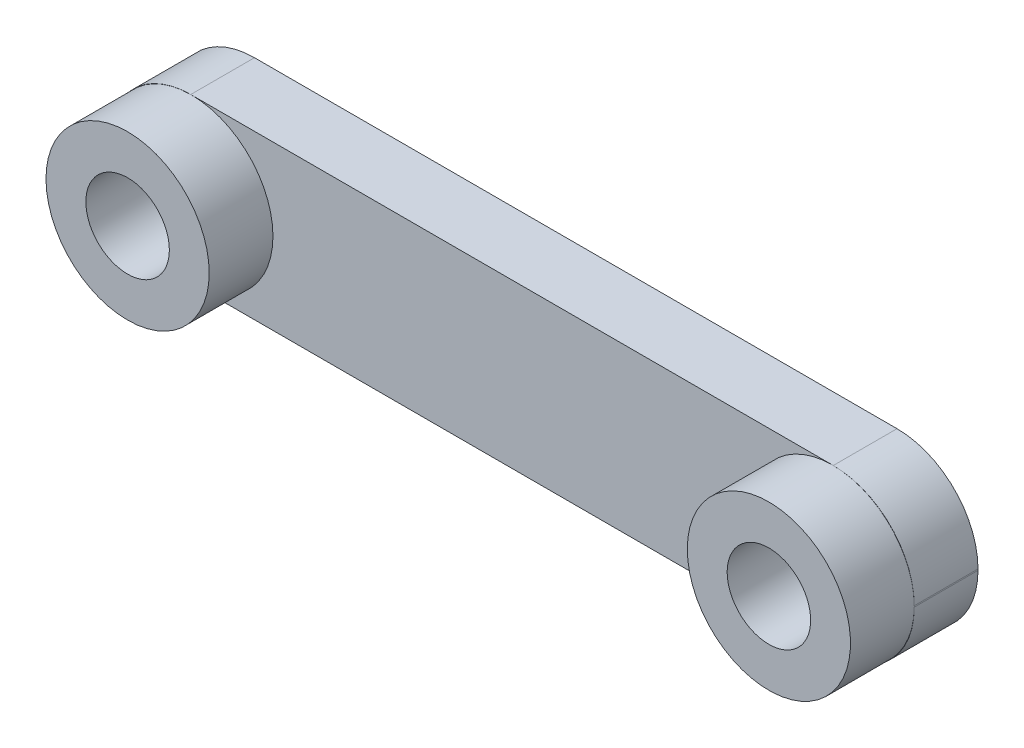
ISO-10303-21;
HEADER;
FILE_DESCRIPTION(('STEP AP214'),'2;1');
FILE_NAME('part.step','',(''),(''),'','','');
FILE_SCHEMA(('AUTOMOTIVE_DESIGN { 1 0 10303 214 1 1 1 1 }'));
ENDSEC;
DATA;
#1=APPLICATION_CONTEXT('core data for automotive mechanical design processes');
#2=APPLICATION_PROTOCOL_DEFINITION('international standard','automotive_design',2000,#1);
#3=PRODUCT_CONTEXT('',#1,'mechanical');
#4=PRODUCT('Part','Part','',(#3));
#5=PRODUCT_RELATED_PRODUCT_CATEGORY('part','',(#4));
#6=PRODUCT_DEFINITION_FORMATION('','',#4);
#7=PRODUCT_DEFINITION_CONTEXT('part definition',#1,'design');
#8=PRODUCT_DEFINITION('design','',#6,#7);
#9=PRODUCT_DEFINITION_SHAPE('','',#8);
#10=(LENGTH_UNIT() NAMED_UNIT(*) SI_UNIT(.MILLI.,.METRE.));
#11=(NAMED_UNIT(*) PLANE_ANGLE_UNIT() SI_UNIT($,.RADIAN.));
#12=(NAMED_UNIT(*) SI_UNIT($,.STERADIAN.) SOLID_ANGLE_UNIT());
#13=UNCERTAINTY_MEASURE_WITH_UNIT(LENGTH_MEASURE(1.E-05),#10,'distance_accuracy_value','');
#14=(GEOMETRIC_REPRESENTATION_CONTEXT(3) GLOBAL_UNCERTAINTY_ASSIGNED_CONTEXT((#13)) GLOBAL_UNIT_ASSIGNED_CONTEXT((#10,
#11,#12)) REPRESENTATION_CONTEXT('',''));
#15=CARTESIAN_POINT('',(0.,0.,0.));
#16=DIRECTION('',(0.,0.,1.));
#17=DIRECTION('',(1.,0.,0.));
#18=AXIS2_PLACEMENT_3D('',#15,#16,#17);
#19=CARTESIAN_POINT('',(0.,0.,10.));
#20=DIRECTION('',(0.,0.,1.));
#21=DIRECTION('',(1.,0.,0.));
#22=AXIS2_PLACEMENT_3D('',#19,#20,#21);
#23=PLANE('',#22);
#24=CARTESIAN_POINT('',(50.296,0.,10.));
#25=DIRECTION('',(0.,0.,-1.));
#26=DIRECTION('',(-1.,0.,0.));
#27=AXIS2_PLACEMENT_3D('',#24,#25,#26);
#28=CIRCLE('',#27,12.8);
#29=CARTESIAN_POINT('',(50.296,12.8,10.));
#30=VERTEX_POINT('',#29);
#31=CARTESIAN_POINT('',(63.0947590335642,0.178233556766903,10.));
#32=VERTEX_POINT('',#31);
#33=EDGE_CURVE('E259',#30,#32,#28,.T.);
#34=ORIENTED_EDGE('',*,*,#33,.T.);
#35=CARTESIAN_POINT('',(50.395,0.100000000000003,10.));
#36=DIRECTION('',(0.,0.,1.));
#37=DIRECTION('',(1.,0.,0.));
#38=AXIS2_PLACEMENT_3D('',#35,#36,#37);
#39=CIRCLE('',#38,12.7);
#40=CARTESIAN_POINT('',(50.395,12.8,10.));
#41=VERTEX_POINT('',#40);
#42=EDGE_CURVE('E45',#32,#41,#39,.T.);
#43=ORIENTED_EDGE('',*,*,#42,.T.);
#44=DIRECTION('',(-1.,0.,0.));
#45=VECTOR('',#44,1.);
#46=CARTESIAN_POINT('',(-63.095,12.8,10.));
#47=LINE('',#46,#45);
#48=EDGE_CURVE('E435',#41,#30,#47,.T.);
#49=ORIENTED_EDGE('',*,*,#48,.T.);
#50=EDGE_LOOP('',(#34,#43,#49));
#51=FACE_BOUND('',#50,.T.);
#52=ADVANCED_FACE('F33',(#51),#23,.T.);
#53=CARTESIAN_POINT('',(50.296,0.,10.));
#54=DIRECTION('',(0.,0.,1.));
#55=DIRECTION('',(1.,0.,0.));
#56=AXIS2_PLACEMENT_3D('',#53,#54,#55);
#57=CIRCLE('',#56,12.8);
#58=CARTESIAN_POINT('',(50.296,-12.8,10.));
#59=VERTEX_POINT('',#58);
#60=EDGE_CURVE('E353',#30,#59,#57,.T.);
#61=ORIENTED_EDGE('',*,*,#60,.F.);
#62=CARTESIAN_POINT('',(-50.296,12.8,10.));
#63=VERTEX_POINT('',#62);
#64=EDGE_CURVE('E451',#30,#63,#47,.T.);
#65=ORIENTED_EDGE('',*,*,#64,.T.);
#66=CARTESIAN_POINT('',(-50.296,0.,10.));
#67=DIRECTION('',(0.,0.,1.));
#68=DIRECTION('',(1.,0.,0.));
#69=AXIS2_PLACEMENT_3D('',#66,#67,#68);
#70=CIRCLE('',#69,12.8);
#71=CARTESIAN_POINT('',(-50.296,-12.8,10.));
#72=VERTEX_POINT('',#71);
#73=EDGE_CURVE('E287',#72,#63,#70,.T.);
#74=ORIENTED_EDGE('',*,*,#73,.F.);
#75=DIRECTION('',(1.,0.,0.));
#76=VECTOR('',#75,1.);
#77=CARTESIAN_POINT('',(-63.095,-12.8,10.));
#78=LINE('',#77,#76);
#79=EDGE_CURVE('E449',#72,#59,#78,.T.);
#80=ORIENTED_EDGE('',*,*,#79,.T.);
#81=EDGE_LOOP('',(#61,#65,#74,#80));
#82=FACE_BOUND('',#81,.T.);
#83=ADVANCED_FACE('F481',(#82),#23,.T.);
#84=CARTESIAN_POINT('',(-50.395,12.8,10.));
#85=VERTEX_POINT('',#84);
#86=EDGE_CURVE('E452',#63,#85,#47,.T.);
#87=ORIENTED_EDGE('',*,*,#86,.T.);
#88=CARTESIAN_POINT('',(-50.395,0.100000000000003,10.));
#89=DIRECTION('',(0.,0.,1.));
#90=DIRECTION('',(1.,0.,0.));
#91=AXIS2_PLACEMENT_3D('',#88,#89,#90);
#92=CIRCLE('',#91,12.7);
#93=CARTESIAN_POINT('',(-63.0947590335641,0.178233556777625,10.));
#94=VERTEX_POINT('',#93);
#95=EDGE_CURVE('E11',#85,#94,#92,.T.);
#96=ORIENTED_EDGE('',*,*,#95,.T.);
#97=EDGE_CURVE('E281',#63,#94,#70,.T.);
#98=ORIENTED_EDGE('',*,*,#97,.F.);
#99=EDGE_LOOP('',(#87,#96,#98));
#100=FACE_BOUND('',#99,.T.);
#101=ADVANCED_FACE('F476',(#100),#23,.T.);
#102=CARTESIAN_POINT('',(-63.0947590335641,-0.178233556777632,10.));
#103=VERTEX_POINT('',#102);
#104=EDGE_CURVE('E291',#103,#72,#70,.T.);
#105=ORIENTED_EDGE('',*,*,#104,.F.);
#106=CARTESIAN_POINT('',(-50.395,-0.0999999999999959,10.));
#107=DIRECTION('',(0.,0.,1.));
#108=DIRECTION('',(1.,0.,0.));
#109=AXIS2_PLACEMENT_3D('',#106,#107,#108);
#110=CIRCLE('',#109,12.7);
#111=CARTESIAN_POINT('',(-50.395,-12.8,10.));
#112=VERTEX_POINT('',#111);
#113=EDGE_CURVE('E332',#103,#112,#110,.T.);
#114=ORIENTED_EDGE('',*,*,#113,.T.);
#115=EDGE_CURVE('E292',#112,#72,#78,.T.);
#116=ORIENTED_EDGE('',*,*,#115,.T.);
#117=EDGE_LOOP('',(#105,#114,#116));
#118=FACE_BOUND('',#117,.T.);
#119=ADVANCED_FACE('F367',(#118),#23,.T.);
#120=CARTESIAN_POINT('',(63.095,12.8,10.));
#121=DIRECTION('',(-1.,0.,0.));
#122=DIRECTION('',(0.,-1.,0.));
#123=AXIS2_PLACEMENT_3D('',#120,#121,#122);
#124=PLANE('',#123);
#125=CARTESIAN_POINT('',(50.296,0.,10.));
#126=DIRECTION('',(0.,0.,1.));
#127=DIRECTION('',(0.999969477597343,-0.00781305789662437,0.));
#128=AXIS2_PLACEMENT_3D('',#125,#126,#127);
#129=CIRCLE('',#128,12.8);
#130=CARTESIAN_POINT('',(63.095304656623,-0.100007141076792,10.));
#131=VERTEX_POINT('',#130);
#132=CARTESIAN_POINT('',(63.095304656623,0.100007141076795,10.));
#133=VERTEX_POINT('',#132);
#134=EDGE_CURVE('E344',#131,#133,#129,.T.);
#135=ORIENTED_EDGE('',*,*,#134,.F.);
#136=DIRECTION('',(0.,0.,-1.));
#137=VECTOR('',#136,1.);
#138=CARTESIAN_POINT('',(63.095,-0.100000000000003,10.));
#139=LINE('',#138,#137);
#140=CARTESIAN_POINT('',(63.095,-0.0999999999999994,0.));
#141=VERTEX_POINT('',#140);
#142=EDGE_CURVE('E160',#131,#141,#139,.T.);
#143=ORIENTED_EDGE('',*,*,#142,.T.);
#144=DIRECTION('',(0.,1.,0.));
#145=VECTOR('',#144,1.);
#146=CARTESIAN_POINT('',(63.095,12.8,0.));
#147=LINE('',#146,#145);
#148=CARTESIAN_POINT('',(63.095,0.0999999999999994,0.));
#149=VERTEX_POINT('',#148);
#150=EDGE_CURVE('E286',#141,#149,#147,.T.);
#151=ORIENTED_EDGE('',*,*,#150,.T.);
#152=DIRECTION('',(0.,0.,-1.));
#153=VECTOR('',#152,1.);
#154=CARTESIAN_POINT('',(63.095,0.0999999999999959,10.));
#155=LINE('',#154,#153);
#156=EDGE_CURVE('E339',#149,#133,#155,.F.);
#157=ORIENTED_EDGE('',*,*,#156,.T.);
#158=EDGE_LOOP('',(#135,#143,#151,#157));
#159=FACE_BOUND('',#158,.T.);
#160=ADVANCED_FACE('F357',(#159),#124,.F.);
#161=CARTESIAN_POINT('',(-63.095,12.8,10.));
#162=DIRECTION('',(0.,-1.,0.));
#163=DIRECTION('',(0.,0.,-1.));
#164=AXIS2_PLACEMENT_3D('',#161,#162,#163);
#165=PLANE('',#164);
#166=ORIENTED_EDGE('',*,*,#48,.F.);
#167=DIRECTION('',(0.,0.,-1.));
#168=VECTOR('',#167,1.);
#169=CARTESIAN_POINT('',(50.395,12.8,10.));
#170=LINE('',#169,#168);
#171=CARTESIAN_POINT('',(50.395,12.8,0.));
#172=VERTEX_POINT('',#171);
#173=EDGE_CURVE('E430',#41,#172,#170,.T.);
#174=ORIENTED_EDGE('',*,*,#173,.T.);
#175=DIRECTION('',(-1.,0.,0.));
#176=VECTOR('',#175,1.);
#177=CARTESIAN_POINT('',(-63.095,12.8,0.));
#178=LINE('',#177,#176);
#179=CARTESIAN_POINT('',(-50.395,12.8,0.));
#180=VERTEX_POINT('',#179);
#181=EDGE_CURVE('E433',#172,#180,#178,.T.);
#182=ORIENTED_EDGE('',*,*,#181,.T.);
#183=DIRECTION('',(0.,0.,-1.));
#184=VECTOR('',#183,1.);
#185=CARTESIAN_POINT('',(-50.395,12.8,10.));
#186=LINE('',#185,#184);
#187=EDGE_CURVE('E60',#180,#85,#186,.F.);
#188=ORIENTED_EDGE('',*,*,#187,.T.);
#189=ORIENTED_EDGE('',*,*,#86,.F.);
#190=ORIENTED_EDGE('',*,*,#64,.F.);
#191=EDGE_LOOP('',(#166,#174,#182,#188,#189,#190));
#192=FACE_BOUND('',#191,.T.);
#193=ADVANCED_FACE('F366',(#192),#165,.F.);
#194=CARTESIAN_POINT('',(-63.095,12.8,10.));
#195=DIRECTION('',(1.,0.,0.));
#196=DIRECTION('',(0.,0.,-1.));
#197=AXIS2_PLACEMENT_3D('',#194,#195,#196);
#198=PLANE('',#197);
#199=DIRECTION('',(0.,-1.,0.));
#200=VECTOR('',#199,1.);
#201=CARTESIAN_POINT('',(-63.095,12.8,0.));
#202=LINE('',#201,#200);
#203=CARTESIAN_POINT('',(-63.095,0.100000000000006,0.));
#204=VERTEX_POINT('',#203);
#205=CARTESIAN_POINT('',(-63.095,-0.0999999999999925,0.));
#206=VERTEX_POINT('',#205);
#207=EDGE_CURVE('E444',#204,#206,#202,.T.);
#208=ORIENTED_EDGE('',*,*,#207,.T.);
#209=DIRECTION('',(0.,0.,-1.));
#210=VECTOR('',#209,1.);
#211=CARTESIAN_POINT('',(-63.095,-0.0999999999999959,10.));
#212=LINE('',#211,#210);
#213=CARTESIAN_POINT('',(-63.095304656623,-0.100007141076798,10.));
#214=VERTEX_POINT('',#213);
#215=EDGE_CURVE('E395',#206,#214,#212,.F.);
#216=ORIENTED_EDGE('',*,*,#215,.T.);
#217=CARTESIAN_POINT('',(-50.296,0.,10.));
#218=DIRECTION('',(0.,0.,1.));
#219=DIRECTION('',(-0.999969477597343,0.00781305789662511,0.));
#220=AXIS2_PLACEMENT_3D('',#217,#218,#219);
#221=CIRCLE('',#220,12.8);
#222=CARTESIAN_POINT('',(-63.095304656623,0.100007141076802,10.));
#223=VERTEX_POINT('',#222);
#224=EDGE_CURVE('E390',#223,#214,#221,.T.);
#225=ORIENTED_EDGE('',*,*,#224,.F.);
#226=DIRECTION('',(0.,0.,-1.));
#227=VECTOR('',#226,1.);
#228=CARTESIAN_POINT('',(-63.095,0.100000000000003,10.));
#229=LINE('',#228,#227);
#230=EDGE_CURVE('E393',#223,#204,#229,.T.);
#231=ORIENTED_EDGE('',*,*,#230,.T.);
#232=EDGE_LOOP('',(#208,#216,#225,#231));
#233=FACE_BOUND('',#232,.T.);
#234=ADVANCED_FACE('F370',(#233),#198,.F.);
#235=CARTESIAN_POINT('',(-63.095,-12.8,10.));
#236=DIRECTION('',(0.,1.,0.));
#237=DIRECTION('',(0.,0.,1.));
#238=AXIS2_PLACEMENT_3D('',#235,#236,#237);
#239=PLANE('',#238);
#240=ORIENTED_EDGE('',*,*,#115,.F.);
#241=DIRECTION('',(0.,0.,-1.));
#242=VECTOR('',#241,1.);
#243=CARTESIAN_POINT('',(-50.395,-12.8,10.));
#244=LINE('',#243,#242);
#245=CARTESIAN_POINT('',(-50.395,-12.8,0.));
#246=VERTEX_POINT('',#245);
#247=EDGE_CURVE('E465',#112,#246,#244,.T.);
#248=ORIENTED_EDGE('',*,*,#247,.T.);
#249=DIRECTION('',(1.,0.,0.));
#250=VECTOR('',#249,1.);
#251=CARTESIAN_POINT('',(-63.095,-12.8,0.));
#252=LINE('',#251,#250);
#253=CARTESIAN_POINT('',(50.395,-12.8,0.));
#254=VERTEX_POINT('',#253);
#255=EDGE_CURVE('E379',#246,#254,#252,.T.);
#256=ORIENTED_EDGE('',*,*,#255,.T.);
#257=DIRECTION('',(0.,0.,-1.));
#258=VECTOR('',#257,1.);
#259=CARTESIAN_POINT('',(50.395,-12.8,10.));
#260=LINE('',#259,#258);
#261=CARTESIAN_POINT('',(50.395,-12.8,10.));
#262=VERTEX_POINT('',#261);
#263=EDGE_CURVE('E463',#254,#262,#260,.F.);
#264=ORIENTED_EDGE('',*,*,#263,.T.);
#265=EDGE_CURVE('E450',#59,#262,#78,.T.);
#266=ORIENTED_EDGE('',*,*,#265,.F.);
#267=ORIENTED_EDGE('',*,*,#79,.F.);
#268=EDGE_LOOP('',(#240,#248,#256,#264,#266,#267));
#269=FACE_BOUND('',#268,.T.);
#270=ADVANCED_FACE('F374',(#269),#239,.F.);
#271=ORIENTED_EDGE('',*,*,#265,.T.);
#272=CARTESIAN_POINT('',(50.395,-0.0999999999999959,10.));
#273=DIRECTION('',(0.,0.,1.));
#274=DIRECTION('',(1.,0.,0.));
#275=AXIS2_PLACEMENT_3D('',#272,#273,#274);
#276=CIRCLE('',#275,12.7);
#277=CARTESIAN_POINT('',(63.0947590335642,-0.1782335567678,10.));
#278=VERTEX_POINT('',#277);
#279=EDGE_CURVE('E467',#262,#278,#276,.T.);
#280=ORIENTED_EDGE('',*,*,#279,.T.);
#281=EDGE_CURVE('E149',#59,#278,#57,.T.);
#282=ORIENTED_EDGE('',*,*,#281,.F.);
#283=EDGE_LOOP('',(#271,#280,#282));
#284=FACE_BOUND('',#283,.T.);
#285=ADVANCED_FACE('F320',(#284),#23,.T.);
#286=CARTESIAN_POINT('',(0.,0.,0.));
#287=DIRECTION('',(0.,0.,1.));
#288=DIRECTION('',(1.,0.,0.));
#289=AXIS2_PLACEMENT_3D('',#286,#287,#288);
#290=PLANE('',#289);
#291=ORIENTED_EDGE('',*,*,#255,.F.);
#292=CARTESIAN_POINT('',(-50.395,-0.0999999999999959,0.));
#293=DIRECTION('',(0.,0.,1.));
#294=DIRECTION('',(1.,0.,0.));
#295=AXIS2_PLACEMENT_3D('',#292,#293,#294);
#296=CIRCLE('',#295,12.7);
#297=EDGE_CURVE('E396',#246,#206,#296,.F.);
#298=ORIENTED_EDGE('',*,*,#297,.T.);
#299=ORIENTED_EDGE('',*,*,#207,.F.);
#300=CARTESIAN_POINT('',(-50.395,0.100000000000003,0.));
#301=DIRECTION('',(0.,0.,1.));
#302=DIRECTION('',(1.,0.,0.));
#303=AXIS2_PLACEMENT_3D('',#300,#301,#302);
#304=CIRCLE('',#303,12.7);
#305=EDGE_CURVE('E443',#204,#180,#304,.F.);
#306=ORIENTED_EDGE('',*,*,#305,.T.);
#307=ORIENTED_EDGE('',*,*,#181,.F.);
#308=CARTESIAN_POINT('',(50.395,0.100000000000003,0.));
#309=DIRECTION('',(0.,0.,1.));
#310=DIRECTION('',(1.,0.,0.));
#311=AXIS2_PLACEMENT_3D('',#308,#309,#310);
#312=CIRCLE('',#311,12.7);
#313=EDGE_CURVE('E440',#172,#149,#312,.F.);
#314=ORIENTED_EDGE('',*,*,#313,.T.);
#315=ORIENTED_EDGE('',*,*,#150,.F.);
#316=CARTESIAN_POINT('',(50.395,-0.0999999999999959,0.));
#317=DIRECTION('',(0.,0.,1.));
#318=DIRECTION('',(1.,0.,0.));
#319=AXIS2_PLACEMENT_3D('',#316,#317,#318);
#320=CIRCLE('',#319,12.7);
#321=EDGE_CURVE('E466',#141,#254,#320,.F.);
#322=ORIENTED_EDGE('',*,*,#321,.T.);
#323=EDGE_LOOP('',(#291,#298,#299,#306,#307,#314,#315,#322));
#324=FACE_BOUND('',#323,.T.);
#325=ADVANCED_FACE('F438',(#324),#290,.F.);
#326=CARTESIAN_POINT('',(-50.296,0.,20.));
#327=DIRECTION('',(0.,0.,1.));
#328=DIRECTION('',(1.,0.,0.));
#329=AXIS2_PLACEMENT_3D('',#326,#327,#328);
#330=PLANE('',#329);
#331=CARTESIAN_POINT('',(-50.296,0.,20.));
#332=DIRECTION('',(0.,0.,1.));
#333=DIRECTION('',(1.,0.,0.));
#334=AXIS2_PLACEMENT_3D('',#331,#332,#333);
#335=CIRCLE('',#334,12.8);
#336=CARTESIAN_POINT('',(-37.496,0.,20.));
#337=VERTEX_POINT('',#336);
#338=EDGE_CURVE('E283',#337,#337,#335,.T.);
#339=ORIENTED_EDGE('',*,*,#338,.T.);
#340=EDGE_LOOP('',(#339));
#341=FACE_BOUND('',#340,.T.);
#342=CARTESIAN_POINT('',(-50.296,0.,20.));
#343=DIRECTION('',(0.,0.,1.));
#344=DIRECTION('',(1.,0.,0.));
#345=AXIS2_PLACEMENT_3D('',#342,#343,#344);
#346=CIRCLE('',#345,6.55);
#347=CARTESIAN_POINT('',(-43.746,0.,20.));
#348=VERTEX_POINT('',#347);
#349=EDGE_CURVE('E274',#348,#348,#346,.T.);
#350=ORIENTED_EDGE('',*,*,#349,.F.);
#351=EDGE_LOOP('',(#350));
#352=FACE_BOUND('',#351,.T.);
#353=ADVANCED_FACE('F318',(#341,#352),#330,.T.);
#354=CARTESIAN_POINT('',(-50.296,0.,20.));
#355=DIRECTION('',(0.,0.,-1.));
#356=DIRECTION('',(-1.,0.,0.));
#357=AXIS2_PLACEMENT_3D('',#354,#355,#356);
#358=CYLINDRICAL_SURFACE('',#357,12.8);
#359=ORIENTED_EDGE('',*,*,#338,.F.);
#360=EDGE_LOOP('',(#359));
#361=FACE_BOUND('',#360,.T.);
#362=ORIENTED_EDGE('',*,*,#224,.T.);
#363=CARTESIAN_POINT('',(-50.296,0.,10.));
#364=DIRECTION('',(0.,0.,1.));
#365=DIRECTION('',(-0.999969479050294,-0.00781287193570041,0.));
#366=AXIS2_PLACEMENT_3D('',#363,#364,#365);
#367=CIRCLE('',#366,12.8);
#368=CARTESIAN_POINT('',(-63.095,-0.159996874973143,10.));
#369=VERTEX_POINT('',#368);
#370=EDGE_CURVE('E340',#214,#369,#367,.T.);
#371=ORIENTED_EDGE('',*,*,#370,.T.);
#372=CARTESIAN_POINT('',(-50.296,0.,10.));
#373=DIRECTION('',(0.,0.,1.));
#374=DIRECTION('',(-0.999921874999996,-0.0124997558572766,0.));
#375=AXIS2_PLACEMENT_3D('',#372,#373,#374);
#376=CIRCLE('',#375,12.8);
#377=EDGE_CURVE('E153',#369,#103,#376,.T.);
#378=ORIENTED_EDGE('',*,*,#377,.T.);
#379=ORIENTED_EDGE('',*,*,#104,.T.);
#380=ORIENTED_EDGE('',*,*,#73,.T.);
#381=ORIENTED_EDGE('',*,*,#97,.T.);
#382=CARTESIAN_POINT('',(-50.296,0.,10.));
#383=DIRECTION('',(0.,0.,1.));
#384=DIRECTION('',(-0.999903049497195,0.0139244966232519,0.));
#385=AXIS2_PLACEMENT_3D('',#382,#383,#384);
#386=CIRCLE('',#385,12.8);
#387=CARTESIAN_POINT('',(-63.095,0.159996874973143,10.));
#388=VERTEX_POINT('',#387);
#389=EDGE_CURVE('E278',#94,#388,#386,.T.);
#390=ORIENTED_EDGE('',*,*,#389,.T.);
#391=CARTESIAN_POINT('',(-50.296,0.,10.));
#392=DIRECTION('',(0.,0.,1.));
#393=DIRECTION('',(-0.999921874977302,0.0124997576727307,0.));
#394=AXIS2_PLACEMENT_3D('',#391,#392,#393);
#395=CIRCLE('',#394,12.8);
#396=EDGE_CURVE('E303',#388,#223,#395,.T.);
#397=ORIENTED_EDGE('',*,*,#396,.T.);
#398=EDGE_LOOP('',(#362,#371,#378,#379,#380,#381,#390,#397));
#399=FACE_BOUND('',#398,.T.);
#400=ADVANCED_FACE('F309',(#361,#399),#358,.T.);
#401=CARTESIAN_POINT('',(-50.296,0.,20.));
#402=DIRECTION('',(0.,0.,-1.));
#403=DIRECTION('',(-1.,0.,0.));
#404=AXIS2_PLACEMENT_3D('',#401,#402,#403);
#405=CYLINDRICAL_SURFACE('',#404,6.55);
#406=ORIENTED_EDGE('',*,*,#349,.T.);
#407=EDGE_LOOP('',(#406));
#408=FACE_BOUND('',#407,.T.);
#409=CARTESIAN_POINT('',(-50.296,0.,4.4));
#410=DIRECTION('',(0.,0.,1.));
#411=DIRECTION('',(1.,0.,0.));
#412=AXIS2_PLACEMENT_3D('',#409,#410,#411);
#413=CIRCLE('',#412,6.55);
#414=CARTESIAN_POINT('',(-43.746,0.,4.4));
#415=VERTEX_POINT('',#414);
#416=EDGE_CURVE('E263',#415,#415,#413,.T.);
#417=ORIENTED_EDGE('',*,*,#416,.F.);
#418=EDGE_LOOP('',(#417));
#419=FACE_BOUND('',#418,.T.);
#420=ADVANCED_FACE('F229',(#408,#419),#405,.F.);
#421=CARTESIAN_POINT('',(50.296,0.,20.));
#422=DIRECTION('',(0.,0.,-1.));
#423=DIRECTION('',(-1.,0.,0.));
#424=AXIS2_PLACEMENT_3D('',#421,#422,#423);
#425=CYLINDRICAL_SURFACE('',#424,12.8);
#426=CARTESIAN_POINT('',(50.296,0.,20.));
#427=DIRECTION('',(0.,0.,-1.));
#428=DIRECTION('',(-1.,0.,0.));
#429=AXIS2_PLACEMENT_3D('',#426,#427,#428);
#430=CIRCLE('',#429,12.8);
#431=CARTESIAN_POINT('',(37.496,0.,20.));
#432=VERTEX_POINT('',#431);
#433=EDGE_CURVE('E261',#432,#432,#430,.T.);
#434=ORIENTED_EDGE('',*,*,#433,.T.);
#435=EDGE_LOOP('',(#434));
#436=FACE_BOUND('',#435,.T.);
#437=CARTESIAN_POINT('',(50.296,0.,10.));
#438=DIRECTION('',(0.,0.,1.));
#439=DIRECTION('',(0.999903049497205,-0.013924496622484,0.));
#440=AXIS2_PLACEMENT_3D('',#437,#438,#439);
#441=CIRCLE('',#440,12.8);
#442=CARTESIAN_POINT('',(63.095,-0.159996874967051,10.));
#443=VERTEX_POINT('',#442);
#444=EDGE_CURVE('E140',#278,#443,#441,.T.);
#445=ORIENTED_EDGE('',*,*,#444,.T.);
#446=CARTESIAN_POINT('',(50.296,0.,10.));
#447=DIRECTION('',(0.,0.,1.));
#448=DIRECTION('',(0.999921874977308,-0.0124997576722549,0.));
#449=AXIS2_PLACEMENT_3D('',#446,#447,#448);
#450=CIRCLE('',#449,12.8);
#451=EDGE_CURVE('E145',#443,#131,#450,.T.);
#452=ORIENTED_EDGE('',*,*,#451,.T.);
#453=ORIENTED_EDGE('',*,*,#134,.T.);
#454=CARTESIAN_POINT('',(50.296,0.,10.));
#455=DIRECTION('',(0.,0.,1.));
#456=DIRECTION('',(0.999969479050294,0.00781287193569984,0.));
#457=AXIS2_PLACEMENT_3D('',#454,#455,#456);
#458=CIRCLE('',#457,12.8);
#459=CARTESIAN_POINT('',(63.095,0.159996874967037,10.));
#460=VERTEX_POINT('',#459);
#461=EDGE_CURVE('E161',#133,#460,#458,.T.);
#462=ORIENTED_EDGE('',*,*,#461,.T.);
#463=CARTESIAN_POINT('',(50.395,0.100000000000003,10.));
#464=DIRECTION('',(0.,0.,-1.));
#465=DIRECTION('',(0.999981026264898,0.00616012258007086,0.));
#466=AXIS2_PLACEMENT_3D('',#463,#464,#465);
#467=CIRCLE('',#466,12.7);
#468=EDGE_CURVE('E212',#32,#460,#467,.T.);
#469=ORIENTED_EDGE('',*,*,#468,.F.);
#470=ORIENTED_EDGE('',*,*,#33,.F.);
#471=ORIENTED_EDGE('',*,*,#60,.T.);
#472=ORIENTED_EDGE('',*,*,#281,.T.);
#473=EDGE_LOOP('',(#445,#452,#453,#462,#469,#470,#471,#472));
#474=FACE_BOUND('',#473,.T.);
#475=ADVANCED_FACE('F143',(#436,#474),#425,.T.);
#476=CARTESIAN_POINT('',(50.296,0.,20.));
#477=DIRECTION('',(0.,0.,1.));
#478=DIRECTION('',(-1.,0.,0.));
#479=AXIS2_PLACEMENT_3D('',#476,#477,#478);
#480=PLANE('',#479);
#481=CARTESIAN_POINT('',(50.296,0.,20.));
#482=DIRECTION('',(0.,0.,-1.));
#483=DIRECTION('',(-1.,0.,0.));
#484=AXIS2_PLACEMENT_3D('',#481,#482,#483);
#485=CIRCLE('',#484,6.55);
#486=CARTESIAN_POINT('',(43.746,0.,20.));
#487=VERTEX_POINT('',#486);
#488=EDGE_CURVE('E260',#487,#487,#485,.T.);
#489=ORIENTED_EDGE('',*,*,#488,.T.);
#490=EDGE_LOOP('',(#489));
#491=FACE_BOUND('',#490,.T.);
#492=ORIENTED_EDGE('',*,*,#433,.F.);
#493=EDGE_LOOP('',(#492));
#494=FACE_BOUND('',#493,.T.);
#495=ADVANCED_FACE('F228',(#491,#494),#480,.T.);
#496=CARTESIAN_POINT('',(50.296,0.,20.));
#497=DIRECTION('',(0.,0.,-1.));
#498=DIRECTION('',(-1.,0.,0.));
#499=AXIS2_PLACEMENT_3D('',#496,#497,#498);
#500=CYLINDRICAL_SURFACE('',#499,6.55);
#501=ORIENTED_EDGE('',*,*,#488,.F.);
#502=EDGE_LOOP('',(#501));
#503=FACE_BOUND('',#502,.T.);
#504=CARTESIAN_POINT('',(50.296,0.,4.4));
#505=DIRECTION('',(0.,0.,-1.));
#506=DIRECTION('',(-1.,0.,0.));
#507=AXIS2_PLACEMENT_3D('',#504,#505,#506);
#508=CIRCLE('',#507,6.55);
#509=CARTESIAN_POINT('',(43.746,0.,4.4));
#510=VERTEX_POINT('',#509);
#511=EDGE_CURVE('E268',#510,#510,#508,.T.);
#512=ORIENTED_EDGE('',*,*,#511,.T.);
#513=EDGE_LOOP('',(#512));
#514=FACE_BOUND('',#513,.T.);
#515=ADVANCED_FACE('F581',(#503,#514),#500,.F.);
#516=CARTESIAN_POINT('',(-50.395,-0.0999999999999959,10.));
#517=DIRECTION('',(0.,0.,-1.));
#518=DIRECTION('',(-1.,0.,0.));
#519=AXIS2_PLACEMENT_3D('',#516,#517,#518);
#520=CYLINDRICAL_SURFACE('',#519,12.7);
#521=ORIENTED_EDGE('',*,*,#370,.F.);
#522=ORIENTED_EDGE('',*,*,#215,.F.);
#523=ORIENTED_EDGE('',*,*,#297,.F.);
#524=ORIENTED_EDGE('',*,*,#247,.F.);
#525=ORIENTED_EDGE('',*,*,#113,.F.);
#526=ORIENTED_EDGE('',*,*,#377,.F.);
#527=EDGE_LOOP('',(#521,#522,#523,#524,#525,#526));
#528=FACE_BOUND('',#527,.T.);
#529=ADVANCED_FACE('F179',(#528),#520,.T.);
#530=CARTESIAN_POINT('',(50.395,-0.0999999999999959,10.));
#531=DIRECTION('',(0.,0.,-1.));
#532=DIRECTION('',(-1.,0.,0.));
#533=AXIS2_PLACEMENT_3D('',#530,#531,#532);
#534=CYLINDRICAL_SURFACE('',#533,12.7);
#535=ORIENTED_EDGE('',*,*,#279,.F.);
#536=ORIENTED_EDGE('',*,*,#263,.F.);
#537=ORIENTED_EDGE('',*,*,#321,.F.);
#538=ORIENTED_EDGE('',*,*,#142,.F.);
#539=ORIENTED_EDGE('',*,*,#451,.F.);
#540=ORIENTED_EDGE('',*,*,#444,.F.);
#541=EDGE_LOOP('',(#535,#536,#537,#538,#539,#540));
#542=FACE_BOUND('',#541,.T.);
#543=ADVANCED_FACE('F158',(#542),#534,.T.);
#544=CARTESIAN_POINT('',(50.395,0.100000000000003,10.));
#545=DIRECTION('',(0.,0.,-1.));
#546=DIRECTION('',(-1.,0.,0.));
#547=AXIS2_PLACEMENT_3D('',#544,#545,#546);
#548=CYLINDRICAL_SURFACE('',#547,12.7);
#549=ORIENTED_EDGE('',*,*,#461,.F.);
#550=ORIENTED_EDGE('',*,*,#156,.F.);
#551=ORIENTED_EDGE('',*,*,#313,.F.);
#552=ORIENTED_EDGE('',*,*,#173,.F.);
#553=ORIENTED_EDGE('',*,*,#42,.F.);
#554=ORIENTED_EDGE('',*,*,#468,.T.);
#555=EDGE_LOOP('',(#549,#550,#551,#552,#553,#554));
#556=FACE_BOUND('',#555,.T.);
#557=ADVANCED_FACE('F178',(#556),#548,.T.);
#558=CARTESIAN_POINT('',(-50.395,0.100000000000003,10.));
#559=DIRECTION('',(0.,0.,-1.));
#560=DIRECTION('',(-1.,0.,0.));
#561=AXIS2_PLACEMENT_3D('',#558,#559,#560);
#562=CYLINDRICAL_SURFACE('',#561,12.7);
#563=ORIENTED_EDGE('',*,*,#95,.F.);
#564=ORIENTED_EDGE('',*,*,#187,.F.);
#565=ORIENTED_EDGE('',*,*,#305,.F.);
#566=ORIENTED_EDGE('',*,*,#230,.F.);
#567=ORIENTED_EDGE('',*,*,#396,.F.);
#568=ORIENTED_EDGE('',*,*,#389,.F.);
#569=EDGE_LOOP('',(#563,#564,#565,#566,#567,#568));
#570=FACE_BOUND('',#569,.T.);
#571=ADVANCED_FACE('F35',(#570),#562,.T.);
#572=CARTESIAN_POINT('',(-50.296,0.,4.4));
#573=DIRECTION('',(0.,0.,1.));
#574=DIRECTION('',(1.,0.,0.));
#575=AXIS2_PLACEMENT_3D('',#572,#573,#574);
#576=PLANE('',#575);
#577=ORIENTED_EDGE('',*,*,#416,.T.);
#578=EDGE_LOOP('',(#577));
#579=FACE_BOUND('',#578,.T.);
#580=ADVANCED_FACE('F602',(#579),#576,.T.);
#581=CARTESIAN_POINT('',(50.296,0.,4.4));
#582=DIRECTION('',(0.,0.,1.));
#583=DIRECTION('',(-1.,0.,0.));
#584=AXIS2_PLACEMENT_3D('',#581,#582,#583);
#585=PLANE('',#584);
#586=ORIENTED_EDGE('',*,*,#511,.F.);
#587=EDGE_LOOP('',(#586));
#588=FACE_BOUND('',#587,.T.);
#589=ADVANCED_FACE('F618',(#588),#585,.T.);
#590=CLOSED_SHELL('',(#52,#83,#101,#119,#160,#193,#234,#270,#285,#325,#353,#400,#420,#475,#495,
#515,#529,#543,#557,#571,#580,#589));
#591=MANIFOLD_SOLID_BREP('B2',#590);
#592=ADVANCED_BREP_SHAPE_REPRESENTATION('',(#18,#591),#14);
#593=SHAPE_DEFINITION_REPRESENTATION(#9,#592);
ENDSEC;
END-ISO-10303-21;
